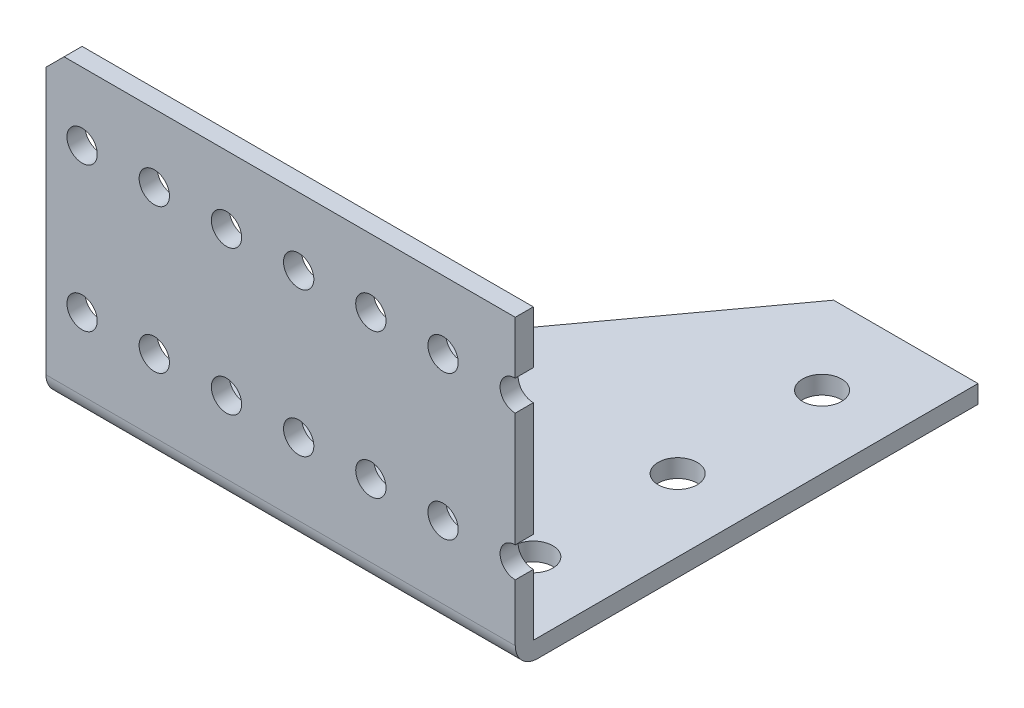
ISO-10303-21;
HEADER;
FILE_DESCRIPTION(('STEP AP214'),'2;1');
FILE_NAME('part.step','',(''),(''),'','','');
FILE_SCHEMA(('AUTOMOTIVE_DESIGN { 1 0 10303 214 1 1 1 1 }'));
ENDSEC;
DATA;
#1=APPLICATION_CONTEXT('core data for automotive mechanical design processes');
#2=APPLICATION_PROTOCOL_DEFINITION('international standard','automotive_design',2000,#1);
#3=PRODUCT_CONTEXT('',#1,'mechanical');
#4=PRODUCT('Part','Part','',(#3));
#5=PRODUCT_RELATED_PRODUCT_CATEGORY('part','',(#4));
#6=PRODUCT_DEFINITION_FORMATION('','',#4);
#7=PRODUCT_DEFINITION_CONTEXT('part definition',#1,'design');
#8=PRODUCT_DEFINITION('design','',#6,#7);
#9=PRODUCT_DEFINITION_SHAPE('','',#8);
#10=(LENGTH_UNIT() NAMED_UNIT(*) SI_UNIT(.MILLI.,.METRE.));
#11=(NAMED_UNIT(*) PLANE_ANGLE_UNIT() SI_UNIT($,.RADIAN.));
#12=(NAMED_UNIT(*) SI_UNIT($,.STERADIAN.) SOLID_ANGLE_UNIT());
#13=UNCERTAINTY_MEASURE_WITH_UNIT(LENGTH_MEASURE(1.E-05),#10,'distance_accuracy_value','');
#14=(GEOMETRIC_REPRESENTATION_CONTEXT(3) GLOBAL_UNCERTAINTY_ASSIGNED_CONTEXT((#13)) GLOBAL_UNIT_ASSIGNED_CONTEXT((#10,
#11,#12)) REPRESENTATION_CONTEXT('',''));
#15=CARTESIAN_POINT('',(0.,0.,0.));
#16=DIRECTION('',(0.,0.,1.));
#17=DIRECTION('',(1.,0.,0.));
#18=AXIS2_PLACEMENT_3D('',#15,#16,#17);
#19=CARTESIAN_POINT('',(41.275,-31.75,40.7035));
#20=DIRECTION('',(-1.,0.,0.));
#21=DIRECTION('',(0.,0.,1.));
#22=AXIS2_PLACEMENT_3D('',#19,#20,#21);
#23=PLANE('',#22);
#24=DIRECTION('',(0.,-1.,0.));
#25=VECTOR('',#24,1.);
#26=CARTESIAN_POINT('',(41.275,-31.75,40.7035));
#27=LINE('',#26,#25);
#28=CARTESIAN_POINT('',(41.275,19.05,40.7035));
#29=VERTEX_POINT('',#28);
#30=CARTESIAN_POINT('',(41.275,9.77899999999999,40.7035));
#31=VERTEX_POINT('',#30);
#32=EDGE_CURVE('E173',#29,#31,#27,.T.);
#33=ORIENTED_EDGE('',*,*,#32,.T.);
#34=DIRECTION('',(0.,0.,-1.));
#35=VECTOR('',#34,1.);
#36=CARTESIAN_POINT('',(41.275,9.779,-40.7035));
#37=LINE('',#36,#35);
#38=CARTESIAN_POINT('',(41.275,9.779,37.5284999999999));
#39=VERTEX_POINT('',#38);
#40=EDGE_CURVE('E186',#31,#39,#37,.T.);
#41=ORIENTED_EDGE('',*,*,#40,.T.);
#42=DIRECTION('',(0.,-1.,0.));
#43=VECTOR('',#42,1.);
#44=CARTESIAN_POINT('',(41.275,19.05,37.5284999999999));
#45=LINE('',#44,#43);
#46=CARTESIAN_POINT('',(41.275,19.05,37.5284999999999));
#47=VERTEX_POINT('',#46);
#48=EDGE_CURVE('E164',#47,#39,#45,.T.);
#49=ORIENTED_EDGE('',*,*,#48,.F.);
#50=DIRECTION('',(0.,0.,-1.));
#51=VECTOR('',#50,1.);
#52=CARTESIAN_POINT('',(41.275,19.05,40.7035));
#53=LINE('',#52,#51);
#54=EDGE_CURVE('E266',#29,#47,#53,.T.);
#55=ORIENTED_EDGE('',*,*,#54,.F.);
#56=EDGE_LOOP('',(#33,#41,#49,#55));
#57=FACE_BOUND('',#56,.T.);
#58=ADVANCED_FACE('F47',(#57),#23,.F.);
#59=CARTESIAN_POINT('',(41.275,4.44500000000004,37.5284999999999));
#60=VERTEX_POINT('',#59);
#61=CARTESIAN_POINT('',(41.275,-15.621,37.5284999999999));
#62=VERTEX_POINT('',#61);
#63=EDGE_CURVE('E274',#60,#62,#45,.T.);
#64=ORIENTED_EDGE('',*,*,#63,.F.);
#65=DIRECTION('',(0.,0.,-1.));
#66=VECTOR('',#65,1.);
#67=CARTESIAN_POINT('',(41.275,4.44500000000004,-40.7035));
#68=LINE('',#67,#66);
#69=CARTESIAN_POINT('',(41.275,4.44500000000004,40.7035));
#70=VERTEX_POINT('',#69);
#71=EDGE_CURVE('E183',#60,#70,#68,.F.);
#72=ORIENTED_EDGE('',*,*,#71,.T.);
#73=CARTESIAN_POINT('',(41.275,-15.621,40.7035));
#74=VERTEX_POINT('',#73);
#75=EDGE_CURVE('E177',#70,#74,#27,.T.);
#76=ORIENTED_EDGE('',*,*,#75,.T.);
#77=DIRECTION('',(0.,0.,-1.));
#78=VECTOR('',#77,1.);
#79=CARTESIAN_POINT('',(41.275,-15.621,-40.7035));
#80=LINE('',#79,#78);
#81=EDGE_CURVE('E180',#74,#62,#80,.T.);
#82=ORIENTED_EDGE('',*,*,#81,.T.);
#83=EDGE_LOOP('',(#64,#72,#76,#82));
#84=FACE_BOUND('',#83,.T.);
#85=ADVANCED_FACE('F286',(#84),#23,.F.);
#86=CARTESIAN_POINT('',(-41.275,-31.75,40.7035));
#87=DIRECTION('',(0.,0.,-1.));
#88=DIRECTION('',(-1.,0.,0.));
#89=AXIS2_PLACEMENT_3D('',#86,#87,#88);
#90=PLANE('',#89);
#91=CARTESIAN_POINT('',(-22.225,7.11200000000002,40.7035));
#92=DIRECTION('',(0.,0.,-1.));
#93=DIRECTION('',(-1.,0.,0.));
#94=AXIS2_PLACEMENT_3D('',#91,#92,#93);
#95=CIRCLE('',#94,2.66699999999997);
#96=CARTESIAN_POINT('',(-24.892,7.11200000000002,40.7035));
#97=VERTEX_POINT('',#96);
#98=EDGE_CURVE('E330',#97,#97,#95,.T.);
#99=ORIENTED_EDGE('',*,*,#98,.T.);
#100=EDGE_LOOP('',(#99));
#101=FACE_BOUND('',#100,.T.);
#102=CARTESIAN_POINT('',(-9.52499999999998,7.11200000000002,40.7035));
#103=DIRECTION('',(0.,0.,-1.));
#104=DIRECTION('',(-1.,0.,0.));
#105=AXIS2_PLACEMENT_3D('',#102,#103,#104);
#106=CIRCLE('',#105,2.66699999999998);
#107=CARTESIAN_POINT('',(-12.192,7.11200000000002,40.7035));
#108=VERTEX_POINT('',#107);
#109=EDGE_CURVE('E217',#108,#108,#106,.T.);
#110=ORIENTED_EDGE('',*,*,#109,.T.);
#111=EDGE_LOOP('',(#110));
#112=FACE_BOUND('',#111,.T.);
#113=CARTESIAN_POINT('',(3.17500000000006,7.11200000000002,40.7035));
#114=DIRECTION('',(0.,0.,-1.));
#115=DIRECTION('',(-1.,0.,0.));
#116=AXIS2_PLACEMENT_3D('',#113,#114,#115);
#117=CIRCLE('',#116,2.66699999999998);
#118=CARTESIAN_POINT('',(0.508000000000084,7.11200000000002,40.7035));
#119=VERTEX_POINT('',#118);
#120=EDGE_CURVE('E216',#119,#119,#117,.T.);
#121=ORIENTED_EDGE('',*,*,#120,.T.);
#122=EDGE_LOOP('',(#121));
#123=FACE_BOUND('',#122,.T.);
#124=CARTESIAN_POINT('',(15.8750000000001,7.11200000000002,40.7035));
#125=DIRECTION('',(0.,0.,-1.));
#126=DIRECTION('',(-1.,0.,0.));
#127=AXIS2_PLACEMENT_3D('',#124,#125,#126);
#128=CIRCLE('',#127,2.66699999999997);
#129=CARTESIAN_POINT('',(13.2080000000001,7.11200000000002,40.7035));
#130=VERTEX_POINT('',#129);
#131=EDGE_CURVE('E340',#130,#130,#128,.T.);
#132=ORIENTED_EDGE('',*,*,#131,.T.);
#133=EDGE_LOOP('',(#132));
#134=FACE_BOUND('',#133,.T.);
#135=CARTESIAN_POINT('',(28.5750000000001,7.11200000000002,40.7035));
#136=DIRECTION('',(0.,0.,-1.));
#137=DIRECTION('',(-1.,0.,0.));
#138=AXIS2_PLACEMENT_3D('',#135,#136,#137);
#139=CIRCLE('',#138,2.66699999999997);
#140=CARTESIAN_POINT('',(25.9080000000001,7.11200000000002,40.7035));
#141=VERTEX_POINT('',#140);
#142=EDGE_CURVE('E212',#141,#141,#139,.T.);
#143=ORIENTED_EDGE('',*,*,#142,.T.);
#144=EDGE_LOOP('',(#143));
#145=FACE_BOUND('',#144,.T.);
#146=CARTESIAN_POINT('',(-22.225,-18.2879999999999,40.7035));
#147=DIRECTION('',(0.,0.,-1.));
#148=DIRECTION('',(-1.,0.,0.));
#149=AXIS2_PLACEMENT_3D('',#146,#147,#148);
#150=CIRCLE('',#149,2.66699999999997);
#151=CARTESIAN_POINT('',(-24.892,-18.2879999999999,40.7035));
#152=VERTEX_POINT('',#151);
#153=EDGE_CURVE('E208',#152,#152,#150,.T.);
#154=ORIENTED_EDGE('',*,*,#153,.T.);
#155=EDGE_LOOP('',(#154));
#156=FACE_BOUND('',#155,.T.);
#157=CARTESIAN_POINT('',(-9.52499999999998,-18.2879999999999,40.7035));
#158=DIRECTION('',(0.,0.,-1.));
#159=DIRECTION('',(-1.,0.,0.));
#160=AXIS2_PLACEMENT_3D('',#157,#158,#159);
#161=CIRCLE('',#160,2.66699999999998);
#162=CARTESIAN_POINT('',(-12.192,-18.2879999999999,40.7035));
#163=VERTEX_POINT('',#162);
#164=EDGE_CURVE('E207',#163,#163,#161,.T.);
#165=ORIENTED_EDGE('',*,*,#164,.T.);
#166=EDGE_LOOP('',(#165));
#167=FACE_BOUND('',#166,.T.);
#168=CARTESIAN_POINT('',(3.17500000000006,-18.2879999999999,40.7035));
#169=DIRECTION('',(0.,0.,-1.));
#170=DIRECTION('',(-1.,0.,0.));
#171=AXIS2_PLACEMENT_3D('',#168,#169,#170);
#172=CIRCLE('',#171,2.66699999999998);
#173=CARTESIAN_POINT('',(0.508000000000084,-18.2879999999999,40.7035));
#174=VERTEX_POINT('',#173);
#175=EDGE_CURVE('E203',#174,#174,#172,.T.);
#176=ORIENTED_EDGE('',*,*,#175,.T.);
#177=EDGE_LOOP('',(#176));
#178=FACE_BOUND('',#177,.T.);
#179=CARTESIAN_POINT('',(15.8750000000001,-18.2879999999999,40.7035));
#180=DIRECTION('',(0.,0.,-1.));
#181=DIRECTION('',(-1.,0.,0.));
#182=AXIS2_PLACEMENT_3D('',#179,#180,#181);
#183=CIRCLE('',#182,2.66699999999997);
#184=CARTESIAN_POINT('',(13.2080000000001,-18.2879999999999,40.7035));
#185=VERTEX_POINT('',#184);
#186=EDGE_CURVE('E202',#185,#185,#183,.T.);
#187=ORIENTED_EDGE('',*,*,#186,.T.);
#188=EDGE_LOOP('',(#187));
#189=FACE_BOUND('',#188,.T.);
#190=CARTESIAN_POINT('',(28.5750000000001,-18.2879999999999,40.7035));
#191=DIRECTION('',(0.,0.,-1.));
#192=DIRECTION('',(-1.,0.,0.));
#193=AXIS2_PLACEMENT_3D('',#190,#191,#192);
#194=CIRCLE('',#193,2.66699999999997);
#195=CARTESIAN_POINT('',(25.9080000000001,-18.2879999999999,40.7035));
#196=VERTEX_POINT('',#195);
#197=EDGE_CURVE('E198',#196,#196,#194,.T.);
#198=ORIENTED_EDGE('',*,*,#197,.T.);
#199=EDGE_LOOP('',(#198));
#200=FACE_BOUND('',#199,.T.);
#201=CARTESIAN_POINT('',(-34.925,7.11200000000002,40.7035));
#202=DIRECTION('',(0.,0.,-1.));
#203=DIRECTION('',(-1.,0.,0.));
#204=AXIS2_PLACEMENT_3D('',#201,#202,#203);
#205=CIRCLE('',#204,2.66699999999997);
#206=CARTESIAN_POINT('',(-37.592,7.11200000000002,40.7035));
#207=VERTEX_POINT('',#206);
#208=EDGE_CURVE('E194',#207,#207,#205,.T.);
#209=ORIENTED_EDGE('',*,*,#208,.T.);
#210=EDGE_LOOP('',(#209));
#211=FACE_BOUND('',#210,.T.);
#212=CARTESIAN_POINT('',(-34.925,-18.2879999999999,40.7035));
#213=DIRECTION('',(0.,0.,-1.));
#214=DIRECTION('',(-1.,0.,0.));
#215=AXIS2_PLACEMENT_3D('',#212,#213,#214);
#216=CIRCLE('',#215,2.66699999999997);
#217=CARTESIAN_POINT('',(-37.592,-18.2879999999999,40.7035));
#218=VERTEX_POINT('',#217);
#219=EDGE_CURVE('E193',#218,#218,#216,.T.);
#220=ORIENTED_EDGE('',*,*,#219,.T.);
#221=EDGE_LOOP('',(#220));
#222=FACE_BOUND('',#221,.T.);
#223=DIRECTION('',(0.,-1.,0.));
#224=VECTOR('',#223,1.);
#225=CARTESIAN_POINT('',(-41.275,-31.75,40.7035));
#226=LINE('',#225,#224);
#227=CARTESIAN_POINT('',(-41.275,15.875,40.7035));
#228=VERTEX_POINT('',#227);
#229=CARTESIAN_POINT('',(-41.275,-30.988,40.7035));
#230=VERTEX_POINT('',#229);
#231=EDGE_CURVE('E168',#228,#230,#226,.T.);
#232=ORIENTED_EDGE('',*,*,#231,.T.);
#233=DIRECTION('',(1.,0.,0.));
#234=VECTOR('',#233,1.);
#235=CARTESIAN_POINT('',(-41.275,-30.988,40.7035));
#236=LINE('',#235,#234);
#237=CARTESIAN_POINT('',(41.275,-30.988,40.7035));
#238=VERTEX_POINT('',#237);
#239=EDGE_CURVE('E226',#230,#238,#236,.T.);
#240=ORIENTED_EDGE('',*,*,#239,.T.);
#241=CARTESIAN_POINT('',(41.275,-20.9549999999999,40.7035));
#242=VERTEX_POINT('',#241);
#243=EDGE_CURVE('E172',#242,#238,#27,.T.);
#244=ORIENTED_EDGE('',*,*,#243,.F.);
#245=CARTESIAN_POINT('',(41.275,-18.2879999999999,40.7035));
#246=DIRECTION('',(0.,0.,-1.));
#247=DIRECTION('',(-1.,0.,0.));
#248=AXIS2_PLACEMENT_3D('',#245,#246,#247);
#249=CIRCLE('',#248,2.66699999999997);
#250=EDGE_CURVE('E268',#242,#74,#249,.T.);
#251=ORIENTED_EDGE('',*,*,#250,.T.);
#252=ORIENTED_EDGE('',*,*,#75,.F.);
#253=CARTESIAN_POINT('',(41.275,7.11200000000002,40.7035));
#254=DIRECTION('',(0.,0.,-1.));
#255=DIRECTION('',(-1.,0.,0.));
#256=AXIS2_PLACEMENT_3D('',#253,#254,#255);
#257=CIRCLE('',#256,2.66699999999997);
#258=EDGE_CURVE('E291',#70,#31,#257,.T.);
#259=ORIENTED_EDGE('',*,*,#258,.T.);
#260=ORIENTED_EDGE('',*,*,#32,.F.);
#261=DIRECTION('',(1.,0.,0.));
#262=VECTOR('',#261,1.);
#263=CARTESIAN_POINT('',(41.275,19.05,40.7035));
#264=LINE('',#263,#262);
#265=CARTESIAN_POINT('',(-38.1,19.05,40.7035));
#266=VERTEX_POINT('',#265);
#267=EDGE_CURVE('E263',#266,#29,#264,.T.);
#268=ORIENTED_EDGE('',*,*,#267,.F.);
#269=DIRECTION('',(0.707106781186544,0.707106781186551,0.));
#270=VECTOR('',#269,1.);
#271=CARTESIAN_POINT('',(-38.1,19.05,40.7035));
#272=LINE('',#271,#270);
#273=EDGE_CURVE('E220',#266,#228,#272,.F.);
#274=ORIENTED_EDGE('',*,*,#273,.T.);
#275=EDGE_LOOP('',(#232,#240,#244,#251,#252,#259,#260,#268,#274));
#276=FACE_BOUND('',#275,.T.);
#277=ADVANCED_FACE('F240',(#101,#112,#123,#134,#145,#156,#167,#178,#189,#200,#211,#222,#276),
#90,.F.);
#278=ORIENTED_EDGE('',*,*,#243,.T.);
#279=CARTESIAN_POINT('',(41.275,-30.988,36.7665));
#280=DIRECTION('',(-1.,0.,0.));
#281=DIRECTION('',(0.,0.,1.));
#282=AXIS2_PLACEMENT_3D('',#279,#280,#281);
#283=CIRCLE('',#282,3.937);
#284=CARTESIAN_POINT('',(41.275,-34.925,36.7665));
#285=VERTEX_POINT('',#284);
#286=EDGE_CURVE('E69',#238,#285,#283,.F.);
#287=ORIENTED_EDGE('',*,*,#286,.T.);
#288=DIRECTION('',(0.,0.,-1.));
#289=VECTOR('',#288,1.);
#290=CARTESIAN_POINT('',(41.275,-34.925,40.7035));
#291=LINE('',#290,#289);
#292=CARTESIAN_POINT('',(41.275,-34.925,-40.7035));
#293=VERTEX_POINT('',#292);
#294=EDGE_CURVE('E160',#285,#293,#291,.T.);
#295=ORIENTED_EDGE('',*,*,#294,.T.);
#296=DIRECTION('',(0.,-1.,0.));
#297=VECTOR('',#296,1.);
#298=CARTESIAN_POINT('',(41.275,-31.75,-40.7035));
#299=LINE('',#298,#297);
#300=CARTESIAN_POINT('',(41.275,-31.75,-40.7035));
#301=VERTEX_POINT('',#300);
#302=EDGE_CURVE('E158',#301,#293,#299,.T.);
#303=ORIENTED_EDGE('',*,*,#302,.F.);
#304=DIRECTION('',(0.,0.,-1.));
#305=VECTOR('',#304,1.);
#306=CARTESIAN_POINT('',(41.275,-31.75,40.7035));
#307=LINE('',#306,#305);
#308=CARTESIAN_POINT('',(41.275,-31.75,37.5284999999999));
#309=VERTEX_POINT('',#308);
#310=EDGE_CURVE('E159',#309,#301,#307,.T.);
#311=ORIENTED_EDGE('',*,*,#310,.F.);
#312=CARTESIAN_POINT('',(41.275,-20.9549999999999,37.5284999999999));
#313=VERTEX_POINT('',#312);
#314=EDGE_CURVE('E257',#313,#309,#45,.T.);
#315=ORIENTED_EDGE('',*,*,#314,.F.);
#316=DIRECTION('',(0.,0.,-1.));
#317=VECTOR('',#316,1.);
#318=CARTESIAN_POINT('',(41.275,-20.9549999999999,-40.7035));
#319=LINE('',#318,#317);
#320=EDGE_CURVE('E176',#313,#242,#319,.F.);
#321=ORIENTED_EDGE('',*,*,#320,.T.);
#322=EDGE_LOOP('',(#278,#287,#295,#303,#311,#315,#321));
#323=FACE_BOUND('',#322,.T.);
#324=ADVANCED_FACE('F289',(#323),#23,.F.);
#325=CARTESIAN_POINT('',(41.275,-31.75,-40.7035));
#326=DIRECTION('',(0.,0.,1.));
#327=DIRECTION('',(1.,0.,0.));
#328=AXIS2_PLACEMENT_3D('',#325,#326,#327);
#329=PLANE('',#328);
#330=DIRECTION('',(-1.,0.,0.));
#331=VECTOR('',#330,1.);
#332=CARTESIAN_POINT('',(41.275,-34.925,-40.7035));
#333=LINE('',#332,#331);
#334=CARTESIAN_POINT('',(15.875,-34.925,-40.7035));
#335=VERTEX_POINT('',#334);
#336=EDGE_CURVE('E150',#293,#335,#333,.T.);
#337=ORIENTED_EDGE('',*,*,#336,.T.);
#338=DIRECTION('',(0.,-1.,0.));
#339=VECTOR('',#338,1.);
#340=CARTESIAN_POINT('',(15.875,19.05,-40.7035));
#341=LINE('',#340,#339);
#342=CARTESIAN_POINT('',(15.875,-31.75,-40.7035));
#343=VERTEX_POINT('',#342);
#344=EDGE_CURVE('E136',#343,#335,#341,.T.);
#345=ORIENTED_EDGE('',*,*,#344,.F.);
#346=DIRECTION('',(-1.,0.,0.));
#347=VECTOR('',#346,1.);
#348=CARTESIAN_POINT('',(41.275,-31.75,-40.7035));
#349=LINE('',#348,#347);
#350=EDGE_CURVE('E162',#301,#343,#349,.T.);
#351=ORIENTED_EDGE('',*,*,#350,.F.);
#352=ORIENTED_EDGE('',*,*,#302,.T.);
#353=EDGE_LOOP('',(#337,#345,#351,#352));
#354=FACE_BOUND('',#353,.T.);
#355=ADVANCED_FACE('F156',(#354),#329,.F.);
#356=CARTESIAN_POINT('',(-41.275,-31.75,40.7035));
#357=DIRECTION('',(1.,0.,0.));
#358=DIRECTION('',(0.,0.,-1.));
#359=AXIS2_PLACEMENT_3D('',#356,#357,#358);
#360=PLANE('',#359);
#361=DIRECTION('',(0.,-1.,0.));
#362=VECTOR('',#361,1.);
#363=CARTESIAN_POINT('',(-41.275,19.05,37.5284999999999));
#364=LINE('',#363,#362);
#365=CARTESIAN_POINT('',(-41.275,15.875,37.5284999999999));
#366=VERTEX_POINT('',#365);
#367=CARTESIAN_POINT('',(-41.275,-31.75,37.5284999999999));
#368=VERTEX_POINT('',#367);
#369=EDGE_CURVE('E254',#366,#368,#364,.T.);
#370=ORIENTED_EDGE('',*,*,#369,.T.);
#371=DIRECTION('',(0.,-1.,0.));
#372=VECTOR('',#371,1.);
#373=CARTESIAN_POINT('',(-41.275,19.05,37.5284999999999));
#374=LINE('',#373,#372);
#375=CARTESIAN_POINT('',(-41.275,-34.8505542067394,37.5284999999999));
#376=VERTEX_POINT('',#375);
#377=EDGE_CURVE('E144',#368,#376,#374,.T.);
#378=ORIENTED_EDGE('',*,*,#377,.T.);
#379=CARTESIAN_POINT('',(-41.275,-30.988,36.7665));
#380=DIRECTION('',(1.,0.,0.));
#381=DIRECTION('',(0.,0.,-1.));
#382=AXIS2_PLACEMENT_3D('',#379,#380,#381);
#383=CIRCLE('',#382,3.937);
#384=EDGE_CURVE('E55',#376,#230,#383,.F.);
#385=ORIENTED_EDGE('',*,*,#384,.T.);
#386=ORIENTED_EDGE('',*,*,#231,.F.);
#387=DIRECTION('',(0.,0.,-1.));
#388=VECTOR('',#387,1.);
#389=CARTESIAN_POINT('',(-41.275,15.875,40.7035));
#390=LINE('',#389,#388);
#391=EDGE_CURVE('E222',#228,#366,#390,.T.);
#392=ORIENTED_EDGE('',*,*,#391,.T.);
#393=EDGE_LOOP('',(#370,#378,#385,#386,#392));
#394=FACE_BOUND('',#393,.T.);
#395=ADVANCED_FACE('F235',(#394),#360,.F.);
#396=CARTESIAN_POINT('',(0.,-31.75,0.));
#397=DIRECTION('',(0.,1.,0.));
#398=DIRECTION('',(0.,0.,1.));
#399=AXIS2_PLACEMENT_3D('',#396,#397,#398);
#400=PLANE('',#399);
#401=DIRECTION('',(0.589885116714,0.,-0.807487181990718));
#402=VECTOR('',#401,1.);
#403=CARTESIAN_POINT('',(-9.03701688787468,-31.75,-6.601716882376));
#404=LINE('',#403,#402);
#405=EDGE_CURVE('E139',#368,#343,#404,.T.);
#406=ORIENTED_EDGE('',*,*,#405,.F.);
#407=DIRECTION('',(-1.,0.,0.));
#408=VECTOR('',#407,1.);
#409=CARTESIAN_POINT('',(-41.275,-31.75,37.5284999999999));
#410=LINE('',#409,#408);
#411=EDGE_CURVE('E249',#309,#368,#410,.T.);
#412=ORIENTED_EDGE('',*,*,#411,.F.);
#413=ORIENTED_EDGE('',*,*,#310,.T.);
#414=ORIENTED_EDGE('',*,*,#350,.T.);
#415=EDGE_LOOP('',(#406,#412,#413,#414));
#416=FACE_BOUND('',#415,.T.);
#417=CARTESIAN_POINT('',(28.575,-31.75,24.8284999999999));
#418=DIRECTION('',(0.,1.,0.));
#419=DIRECTION('',(0.,0.,1.));
#420=AXIS2_PLACEMENT_3D('',#417,#418,#419);
#421=CIRCLE('',#420,3.429);
#422=CARTESIAN_POINT('',(28.575,-31.75,28.2574999999999));
#423=VERTEX_POINT('',#422);
#424=EDGE_CURVE('E620',#423,#423,#421,.T.);
#425=ORIENTED_EDGE('',*,*,#424,.F.);
#426=EDGE_LOOP('',(#425));
#427=FACE_BOUND('',#426,.T.);
#428=CARTESIAN_POINT('',(28.5750000000003,-31.75,-0.571500000000103));
#429=DIRECTION('',(0.,1.,0.));
#430=DIRECTION('',(0.,0.,1.));
#431=AXIS2_PLACEMENT_3D('',#428,#429,#430);
#432=CIRCLE('',#431,3.429);
#433=CARTESIAN_POINT('',(28.5750000000003,-31.75,2.8574999999999));
#434=VERTEX_POINT('',#433);
#435=EDGE_CURVE('E634',#434,#434,#432,.T.);
#436=ORIENTED_EDGE('',*,*,#435,.F.);
#437=EDGE_LOOP('',(#436));
#438=FACE_BOUND('',#437,.T.);
#439=CARTESIAN_POINT('',(28.5750000000005,-31.75,-25.9715000000001));
#440=DIRECTION('',(0.,1.,0.));
#441=DIRECTION('',(0.,0.,1.));
#442=AXIS2_PLACEMENT_3D('',#439,#440,#441);
#443=CIRCLE('',#442,3.429);
#444=CARTESIAN_POINT('',(28.5750000000005,-31.75,-22.5425000000001));
#445=VERTEX_POINT('',#444);
#446=EDGE_CURVE('E251',#445,#445,#443,.T.);
#447=ORIENTED_EDGE('',*,*,#446,.F.);
#448=EDGE_LOOP('',(#447));
#449=FACE_BOUND('',#448,.T.);
#450=ADVANCED_FACE('F246',(#416,#427,#438,#449),#400,.T.);
#451=CARTESIAN_POINT('',(0.,-34.925,0.));
#452=DIRECTION('',(0.,1.,0.));
#453=DIRECTION('',(0.,0.,1.));
#454=AXIS2_PLACEMENT_3D('',#451,#452,#453);
#455=PLANE('',#454);
#456=CARTESIAN_POINT('',(28.575,-34.925,24.8284999999999));
#457=DIRECTION('',(0.,-1.,0.));
#458=DIRECTION('',(0.,0.,-1.));
#459=AXIS2_PLACEMENT_3D('',#456,#457,#458);
#460=CIRCLE('',#459,3.429);
#461=CARTESIAN_POINT('',(28.575,-34.925,21.3994999999999));
#462=VERTEX_POINT('',#461);
#463=EDGE_CURVE('E153',#462,#462,#460,.T.);
#464=ORIENTED_EDGE('',*,*,#463,.F.);
#465=EDGE_LOOP('',(#464));
#466=FACE_BOUND('',#465,.T.);
#467=CARTESIAN_POINT('',(28.5750000000003,-34.925,-0.571500000000103));
#468=DIRECTION('',(0.,-1.,0.));
#469=DIRECTION('',(0.,0.,-1.));
#470=AXIS2_PLACEMENT_3D('',#467,#468,#469);
#471=CIRCLE('',#470,3.429);
#472=CARTESIAN_POINT('',(28.5750000000003,-34.925,-4.0005000000001));
#473=VERTEX_POINT('',#472);
#474=EDGE_CURVE('E623',#473,#473,#471,.T.);
#475=ORIENTED_EDGE('',*,*,#474,.F.);
#476=EDGE_LOOP('',(#475));
#477=FACE_BOUND('',#476,.T.);
#478=CARTESIAN_POINT('',(28.5750000000005,-34.925,-25.9715000000001));
#479=DIRECTION('',(0.,-1.,0.));
#480=DIRECTION('',(0.,0.,-1.));
#481=AXIS2_PLACEMENT_3D('',#478,#479,#480);
#482=CIRCLE('',#481,3.429);
#483=CARTESIAN_POINT('',(28.5750000000005,-34.925,-29.4005000000001));
#484=VERTEX_POINT('',#483);
#485=EDGE_CURVE('E626',#484,#484,#482,.T.);
#486=ORIENTED_EDGE('',*,*,#485,.F.);
#487=EDGE_LOOP('',(#486));
#488=FACE_BOUND('',#487,.T.);
#489=DIRECTION('',(1.,0.,0.));
#490=VECTOR('',#489,1.);
#491=CARTESIAN_POINT('',(0.,-34.925,36.7665));
#492=LINE('',#491,#490);
#493=CARTESIAN_POINT('',(-40.7183441558442,-34.925,36.7665));
#494=VERTEX_POINT('',#493);
#495=EDGE_CURVE('E152',#285,#494,#492,.F.);
#496=ORIENTED_EDGE('',*,*,#495,.T.);
#497=DIRECTION('',(-0.589885116714,0.,0.807487181990718));
#498=VECTOR('',#497,1.);
#499=CARTESIAN_POINT('',(-41.275,-34.925,37.5284999999999));
#500=LINE('',#499,#498);
#501=EDGE_CURVE('E61',#335,#494,#500,.T.);
#502=ORIENTED_EDGE('',*,*,#501,.F.);
#503=ORIENTED_EDGE('',*,*,#336,.F.);
#504=ORIENTED_EDGE('',*,*,#294,.F.);
#505=EDGE_LOOP('',(#496,#502,#503,#504));
#506=FACE_BOUND('',#505,.T.);
#507=ADVANCED_FACE('F149',(#466,#477,#488,#506),#455,.F.);
#508=CARTESIAN_POINT('',(-41.275,19.05,37.5284999999999));
#509=DIRECTION('',(0.,0.,1.));
#510=DIRECTION('',(1.,0.,0.));
#511=AXIS2_PLACEMENT_3D('',#508,#509,#510);
#512=PLANE('',#511);
#513=CARTESIAN_POINT('',(-22.225,7.11200000000002,37.5284999999999));
#514=DIRECTION('',(0.,0.,1.));
#515=DIRECTION('',(1.,0.,0.));
#516=AXIS2_PLACEMENT_3D('',#513,#514,#515);
#517=CIRCLE('',#516,2.66699999999998);
#518=CARTESIAN_POINT('',(-19.558,7.11200000000002,37.5284999999999));
#519=VERTEX_POINT('',#518);
#520=EDGE_CURVE('E639',#519,#519,#517,.T.);
#521=ORIENTED_EDGE('',*,*,#520,.T.);
#522=EDGE_LOOP('',(#521));
#523=FACE_BOUND('',#522,.T.);
#524=CARTESIAN_POINT('',(-9.52499999999998,7.11200000000002,37.5284999999999));
#525=DIRECTION('',(0.,0.,1.));
#526=DIRECTION('',(1.,0.,0.));
#527=AXIS2_PLACEMENT_3D('',#524,#525,#526);
#528=CIRCLE('',#527,2.66699999999998);
#529=CARTESIAN_POINT('',(-6.858,7.11200000000002,37.5284999999999));
#530=VERTEX_POINT('',#529);
#531=EDGE_CURVE('E213',#530,#530,#528,.T.);
#532=ORIENTED_EDGE('',*,*,#531,.T.);
#533=EDGE_LOOP('',(#532));
#534=FACE_BOUND('',#533,.T.);
#535=CARTESIAN_POINT('',(3.17500000000006,7.11200000000002,37.5284999999999));
#536=DIRECTION('',(0.,0.,1.));
#537=DIRECTION('',(1.,0.,0.));
#538=AXIS2_PLACEMENT_3D('',#535,#536,#537);
#539=CIRCLE('',#538,2.66699999999998);
#540=CARTESIAN_POINT('',(5.84200000000004,7.11200000000002,37.5284999999999));
#541=VERTEX_POINT('',#540);
#542=EDGE_CURVE('E644',#541,#541,#539,.T.);
#543=ORIENTED_EDGE('',*,*,#542,.T.);
#544=EDGE_LOOP('',(#543));
#545=FACE_BOUND('',#544,.T.);
#546=CARTESIAN_POINT('',(15.8750000000001,7.11200000000002,37.5284999999999));
#547=DIRECTION('',(0.,0.,1.));
#548=DIRECTION('',(1.,0.,0.));
#549=AXIS2_PLACEMENT_3D('',#546,#547,#548);
#550=CIRCLE('',#549,2.66699999999998);
#551=CARTESIAN_POINT('',(18.5420000000001,7.11200000000002,37.5284999999999));
#552=VERTEX_POINT('',#551);
#553=EDGE_CURVE('E648',#552,#552,#550,.T.);
#554=ORIENTED_EDGE('',*,*,#553,.T.);
#555=EDGE_LOOP('',(#554));
#556=FACE_BOUND('',#555,.T.);
#557=CARTESIAN_POINT('',(28.5750000000001,7.11200000000002,37.5284999999999));
#558=DIRECTION('',(0.,0.,1.));
#559=DIRECTION('',(1.,0.,0.));
#560=AXIS2_PLACEMENT_3D('',#557,#558,#559);
#561=CIRCLE('',#560,2.66699999999998);
#562=CARTESIAN_POINT('',(31.2420000000001,7.11200000000002,37.5284999999999));
#563=VERTEX_POINT('',#562);
#564=EDGE_CURVE('E209',#563,#563,#561,.T.);
#565=ORIENTED_EDGE('',*,*,#564,.T.);
#566=EDGE_LOOP('',(#565));
#567=FACE_BOUND('',#566,.T.);
#568=CARTESIAN_POINT('',(-22.225,-18.2879999999999,37.5284999999999));
#569=DIRECTION('',(0.,0.,1.));
#570=DIRECTION('',(1.,0.,0.));
#571=AXIS2_PLACEMENT_3D('',#568,#569,#570);
#572=CIRCLE('',#571,2.66699999999998);
#573=CARTESIAN_POINT('',(-19.558,-18.2879999999999,37.5284999999999));
#574=VERTEX_POINT('',#573);
#575=EDGE_CURVE('E204',#574,#574,#572,.T.);
#576=ORIENTED_EDGE('',*,*,#575,.T.);
#577=EDGE_LOOP('',(#576));
#578=FACE_BOUND('',#577,.T.);
#579=CARTESIAN_POINT('',(-9.52499999999998,-18.2879999999999,37.5284999999999));
#580=DIRECTION('',(0.,0.,1.));
#581=DIRECTION('',(1.,0.,0.));
#582=AXIS2_PLACEMENT_3D('',#579,#580,#581);
#583=CIRCLE('',#582,2.66699999999998);
#584=CARTESIAN_POINT('',(-6.858,-18.2879999999999,37.5284999999999));
#585=VERTEX_POINT('',#584);
#586=EDGE_CURVE('E654',#585,#585,#583,.T.);
#587=ORIENTED_EDGE('',*,*,#586,.T.);
#588=EDGE_LOOP('',(#587));
#589=FACE_BOUND('',#588,.T.);
#590=CARTESIAN_POINT('',(3.17500000000006,-18.2879999999999,37.5284999999999));
#591=DIRECTION('',(0.,0.,1.));
#592=DIRECTION('',(1.,0.,0.));
#593=AXIS2_PLACEMENT_3D('',#590,#591,#592);
#594=CIRCLE('',#593,2.66699999999998);
#595=CARTESIAN_POINT('',(5.84200000000004,-18.2879999999999,37.5284999999999));
#596=VERTEX_POINT('',#595);
#597=EDGE_CURVE('E199',#596,#596,#594,.T.);
#598=ORIENTED_EDGE('',*,*,#597,.T.);
#599=EDGE_LOOP('',(#598));
#600=FACE_BOUND('',#599,.T.);
#601=CARTESIAN_POINT('',(15.8750000000001,-18.2879999999999,37.5284999999999));
#602=DIRECTION('',(0.,0.,1.));
#603=DIRECTION('',(1.,0.,0.));
#604=AXIS2_PLACEMENT_3D('',#601,#602,#603);
#605=CIRCLE('',#604,2.66699999999998);
#606=CARTESIAN_POINT('',(18.5420000000001,-18.2879999999999,37.5284999999999));
#607=VERTEX_POINT('',#606);
#608=EDGE_CURVE('E659',#607,#607,#605,.T.);
#609=ORIENTED_EDGE('',*,*,#608,.T.);
#610=EDGE_LOOP('',(#609));
#611=FACE_BOUND('',#610,.T.);
#612=CARTESIAN_POINT('',(28.5750000000001,-18.2879999999999,37.5284999999999));
#613=DIRECTION('',(0.,0.,1.));
#614=DIRECTION('',(1.,0.,0.));
#615=AXIS2_PLACEMENT_3D('',#612,#613,#614);
#616=CIRCLE('',#615,2.66699999999998);
#617=CARTESIAN_POINT('',(31.2420000000001,-18.2879999999999,37.5284999999999));
#618=VERTEX_POINT('',#617);
#619=EDGE_CURVE('E195',#618,#618,#616,.T.);
#620=ORIENTED_EDGE('',*,*,#619,.T.);
#621=EDGE_LOOP('',(#620));
#622=FACE_BOUND('',#621,.T.);
#623=CARTESIAN_POINT('',(-34.925,7.11200000000002,37.5284999999999));
#624=DIRECTION('',(0.,0.,1.));
#625=DIRECTION('',(1.,0.,0.));
#626=AXIS2_PLACEMENT_3D('',#623,#624,#625);
#627=CIRCLE('',#626,2.66699999999998);
#628=CARTESIAN_POINT('',(-32.258,7.11200000000002,37.5284999999999));
#629=VERTEX_POINT('',#628);
#630=EDGE_CURVE('E190',#629,#629,#627,.T.);
#631=ORIENTED_EDGE('',*,*,#630,.T.);
#632=EDGE_LOOP('',(#631));
#633=FACE_BOUND('',#632,.T.);
#634=CARTESIAN_POINT('',(-34.925,-18.2879999999999,37.5284999999999));
#635=DIRECTION('',(0.,0.,1.));
#636=DIRECTION('',(1.,0.,0.));
#637=AXIS2_PLACEMENT_3D('',#634,#635,#636);
#638=CIRCLE('',#637,2.66699999999998);
#639=CARTESIAN_POINT('',(-32.258,-18.2879999999999,37.5284999999999));
#640=VERTEX_POINT('',#639);
#641=EDGE_CURVE('E365',#640,#640,#638,.T.);
#642=ORIENTED_EDGE('',*,*,#641,.T.);
#643=EDGE_LOOP('',(#642));
#644=FACE_BOUND('',#643,.T.);
#645=ORIENTED_EDGE('',*,*,#369,.F.);
#646=DIRECTION('',(-0.707106781186544,-0.707106781186551,0.));
#647=VECTOR('',#646,1.);
#648=CARTESIAN_POINT('',(-38.1,19.05,37.5284999999999));
#649=LINE('',#648,#647);
#650=CARTESIAN_POINT('',(-38.1,19.05,37.5284999999999));
#651=VERTEX_POINT('',#650);
#652=EDGE_CURVE('E224',#366,#651,#649,.F.);
#653=ORIENTED_EDGE('',*,*,#652,.T.);
#654=DIRECTION('',(-1.,0.,0.));
#655=VECTOR('',#654,1.);
#656=CARTESIAN_POINT('',(-41.275,19.05,37.5284999999999));
#657=LINE('',#656,#655);
#658=EDGE_CURVE('E258',#47,#651,#657,.T.);
#659=ORIENTED_EDGE('',*,*,#658,.F.);
#660=ORIENTED_EDGE('',*,*,#48,.T.);
#661=CARTESIAN_POINT('',(41.275,7.11200000000002,37.5284999999999));
#662=DIRECTION('',(0.,0.,1.));
#663=DIRECTION('',(1.,0.,0.));
#664=AXIS2_PLACEMENT_3D('',#661,#662,#663);
#665=CIRCLE('',#664,2.66699999999998);
#666=EDGE_CURVE('E280',#39,#60,#665,.T.);
#667=ORIENTED_EDGE('',*,*,#666,.T.);
#668=ORIENTED_EDGE('',*,*,#63,.T.);
#669=CARTESIAN_POINT('',(41.275,-18.2879999999999,37.5284999999999));
#670=DIRECTION('',(0.,0.,1.));
#671=DIRECTION('',(1.,0.,0.));
#672=AXIS2_PLACEMENT_3D('',#669,#670,#671);
#673=CIRCLE('',#672,2.66699999999998);
#674=EDGE_CURVE('E264',#62,#313,#673,.T.);
#675=ORIENTED_EDGE('',*,*,#674,.T.);
#676=ORIENTED_EDGE('',*,*,#314,.T.);
#677=ORIENTED_EDGE('',*,*,#411,.T.);
#678=EDGE_LOOP('',(#645,#653,#659,#660,#667,#668,#675,#676,#677));
#679=FACE_BOUND('',#678,.T.);
#680=ADVANCED_FACE('F260',(#523,#534,#545,#556,#567,#578,#589,#600,#611,#622,#633,#644,#679),
#512,.F.);
#681=CARTESIAN_POINT('',(0.,19.05,0.));
#682=DIRECTION('',(0.,-1.,0.));
#683=DIRECTION('',(0.,0.,-1.));
#684=AXIS2_PLACEMENT_3D('',#681,#682,#683);
#685=PLANE('',#684);
#686=ORIENTED_EDGE('',*,*,#658,.T.);
#687=DIRECTION('',(0.,0.,1.));
#688=VECTOR('',#687,1.);
#689=CARTESIAN_POINT('',(-38.1,19.05,0.));
#690=LINE('',#689,#688);
#691=EDGE_CURVE('E189',#651,#266,#690,.T.);
#692=ORIENTED_EDGE('',*,*,#691,.T.);
#693=ORIENTED_EDGE('',*,*,#267,.T.);
#694=ORIENTED_EDGE('',*,*,#54,.T.);
#695=EDGE_LOOP('',(#686,#692,#693,#694));
#696=FACE_BOUND('',#695,.T.);
#697=ADVANCED_FACE('F298',(#696),#685,.F.);
#698=CARTESIAN_POINT('',(41.275,-18.2879999999999,-40.7035));
#699=DIRECTION('',(0.,0.,-1.));
#700=DIRECTION('',(-1.,0.,0.));
#701=AXIS2_PLACEMENT_3D('',#698,#699,#700);
#702=CYLINDRICAL_SURFACE('',#701,2.66699999999998);
#703=ORIENTED_EDGE('',*,*,#250,.F.);
#704=ORIENTED_EDGE('',*,*,#320,.F.);
#705=ORIENTED_EDGE('',*,*,#674,.F.);
#706=ORIENTED_EDGE('',*,*,#81,.F.);
#707=EDGE_LOOP('',(#703,#704,#705,#706));
#708=FACE_BOUND('',#707,.T.);
#709=ADVANCED_FACE('F284',(#708),#702,.F.);
#710=CARTESIAN_POINT('',(41.275,7.11200000000002,-40.7035));
#711=DIRECTION('',(0.,0.,-1.));
#712=DIRECTION('',(-1.,0.,0.));
#713=AXIS2_PLACEMENT_3D('',#710,#711,#712);
#714=CYLINDRICAL_SURFACE('',#713,2.66699999999998);
#715=ORIENTED_EDGE('',*,*,#258,.F.);
#716=ORIENTED_EDGE('',*,*,#71,.F.);
#717=ORIENTED_EDGE('',*,*,#666,.F.);
#718=ORIENTED_EDGE('',*,*,#40,.F.);
#719=EDGE_LOOP('',(#715,#716,#717,#718));
#720=FACE_BOUND('',#719,.T.);
#721=ADVANCED_FACE('F373',(#720),#714,.F.);
#722=CARTESIAN_POINT('',(-34.925,-18.2879999999999,-40.7035));
#723=DIRECTION('',(0.,0.,-1.));
#724=DIRECTION('',(-1.,0.,0.));
#725=AXIS2_PLACEMENT_3D('',#722,#723,#724);
#726=CYLINDRICAL_SURFACE('',#725,2.66699999999998);
#727=ORIENTED_EDGE('',*,*,#219,.F.);
#728=EDGE_LOOP('',(#727));
#729=FACE_BOUND('',#728,.T.);
#730=ORIENTED_EDGE('',*,*,#641,.F.);
#731=EDGE_LOOP('',(#730));
#732=FACE_BOUND('',#731,.T.);
#733=ADVANCED_FACE('F375',(#729,#732),#726,.F.);
#734=CARTESIAN_POINT('',(-34.925,7.11200000000002,-40.7035));
#735=DIRECTION('',(0.,0.,-1.));
#736=DIRECTION('',(-1.,0.,0.));
#737=AXIS2_PLACEMENT_3D('',#734,#735,#736);
#738=CYLINDRICAL_SURFACE('',#737,2.66699999999998);
#739=ORIENTED_EDGE('',*,*,#208,.F.);
#740=EDGE_LOOP('',(#739));
#741=FACE_BOUND('',#740,.T.);
#742=ORIENTED_EDGE('',*,*,#630,.F.);
#743=EDGE_LOOP('',(#742));
#744=FACE_BOUND('',#743,.T.);
#745=ADVANCED_FACE('F381',(#741,#744),#738,.F.);
#746=CARTESIAN_POINT('',(28.5750000000001,-18.2879999999999,-40.7035));
#747=DIRECTION('',(0.,0.,-1.));
#748=DIRECTION('',(-1.,0.,0.));
#749=AXIS2_PLACEMENT_3D('',#746,#747,#748);
#750=CYLINDRICAL_SURFACE('',#749,2.66699999999998);
#751=ORIENTED_EDGE('',*,*,#197,.F.);
#752=EDGE_LOOP('',(#751));
#753=FACE_BOUND('',#752,.T.);
#754=ORIENTED_EDGE('',*,*,#619,.F.);
#755=EDGE_LOOP('',(#754));
#756=FACE_BOUND('',#755,.T.);
#757=ADVANCED_FACE('F449',(#753,#756),#750,.F.);
#758=CARTESIAN_POINT('',(15.8750000000001,-18.2879999999999,-40.7035));
#759=DIRECTION('',(0.,0.,-1.));
#760=DIRECTION('',(-1.,0.,0.));
#761=AXIS2_PLACEMENT_3D('',#758,#759,#760);
#762=CYLINDRICAL_SURFACE('',#761,2.66699999999998);
#763=ORIENTED_EDGE('',*,*,#186,.F.);
#764=EDGE_LOOP('',(#763));
#765=FACE_BOUND('',#764,.T.);
#766=ORIENTED_EDGE('',*,*,#608,.F.);
#767=EDGE_LOOP('',(#766));
#768=FACE_BOUND('',#767,.T.);
#769=ADVANCED_FACE('F459',(#765,#768),#762,.F.);
#770=CARTESIAN_POINT('',(3.17500000000006,-18.2879999999999,-40.7035));
#771=DIRECTION('',(0.,0.,-1.));
#772=DIRECTION('',(-1.,0.,0.));
#773=AXIS2_PLACEMENT_3D('',#770,#771,#772);
#774=CYLINDRICAL_SURFACE('',#773,2.66699999999998);
#775=ORIENTED_EDGE('',*,*,#175,.F.);
#776=EDGE_LOOP('',(#775));
#777=FACE_BOUND('',#776,.T.);
#778=ORIENTED_EDGE('',*,*,#597,.F.);
#779=EDGE_LOOP('',(#778));
#780=FACE_BOUND('',#779,.T.);
#781=ADVANCED_FACE('F470',(#777,#780),#774,.F.);
#782=CARTESIAN_POINT('',(-9.52499999999998,-18.2879999999999,-40.7035));
#783=DIRECTION('',(0.,0.,-1.));
#784=DIRECTION('',(-1.,0.,0.));
#785=AXIS2_PLACEMENT_3D('',#782,#783,#784);
#786=CYLINDRICAL_SURFACE('',#785,2.66699999999998);
#787=ORIENTED_EDGE('',*,*,#164,.F.);
#788=EDGE_LOOP('',(#787));
#789=FACE_BOUND('',#788,.T.);
#790=ORIENTED_EDGE('',*,*,#586,.F.);
#791=EDGE_LOOP('',(#790));
#792=FACE_BOUND('',#791,.T.);
#793=ADVANCED_FACE('F481',(#789,#792),#786,.F.);
#794=CARTESIAN_POINT('',(-22.225,-18.2879999999999,-40.7035));
#795=DIRECTION('',(0.,0.,-1.));
#796=DIRECTION('',(-1.,0.,0.));
#797=AXIS2_PLACEMENT_3D('',#794,#795,#796);
#798=CYLINDRICAL_SURFACE('',#797,2.66699999999998);
#799=ORIENTED_EDGE('',*,*,#153,.F.);
#800=EDGE_LOOP('',(#799));
#801=FACE_BOUND('',#800,.T.);
#802=ORIENTED_EDGE('',*,*,#575,.F.);
#803=EDGE_LOOP('',(#802));
#804=FACE_BOUND('',#803,.T.);
#805=ADVANCED_FACE('F492',(#801,#804),#798,.F.);
#806=CARTESIAN_POINT('',(28.5750000000001,7.11200000000002,-40.7035));
#807=DIRECTION('',(0.,0.,-1.));
#808=DIRECTION('',(-1.,0.,0.));
#809=AXIS2_PLACEMENT_3D('',#806,#807,#808);
#810=CYLINDRICAL_SURFACE('',#809,2.66699999999998);
#811=ORIENTED_EDGE('',*,*,#142,.F.);
#812=EDGE_LOOP('',(#811));
#813=FACE_BOUND('',#812,.T.);
#814=ORIENTED_EDGE('',*,*,#564,.F.);
#815=EDGE_LOOP('',(#814));
#816=FACE_BOUND('',#815,.T.);
#817=ADVANCED_FACE('F503',(#813,#816),#810,.F.);
#818=CARTESIAN_POINT('',(15.8750000000001,7.11200000000002,-40.7035));
#819=DIRECTION('',(0.,0.,-1.));
#820=DIRECTION('',(-1.,0.,0.));
#821=AXIS2_PLACEMENT_3D('',#818,#819,#820);
#822=CYLINDRICAL_SURFACE('',#821,2.66699999999998);
#823=ORIENTED_EDGE('',*,*,#131,.F.);
#824=EDGE_LOOP('',(#823));
#825=FACE_BOUND('',#824,.T.);
#826=ORIENTED_EDGE('',*,*,#553,.F.);
#827=EDGE_LOOP('',(#826));
#828=FACE_BOUND('',#827,.T.);
#829=ADVANCED_FACE('F514',(#825,#828),#822,.F.);
#830=CARTESIAN_POINT('',(3.17500000000006,7.11200000000002,-40.7035));
#831=DIRECTION('',(0.,0.,-1.));
#832=DIRECTION('',(-1.,0.,0.));
#833=AXIS2_PLACEMENT_3D('',#830,#831,#832);
#834=CYLINDRICAL_SURFACE('',#833,2.66699999999998);
#835=ORIENTED_EDGE('',*,*,#120,.F.);
#836=EDGE_LOOP('',(#835));
#837=FACE_BOUND('',#836,.T.);
#838=ORIENTED_EDGE('',*,*,#542,.F.);
#839=EDGE_LOOP('',(#838));
#840=FACE_BOUND('',#839,.T.);
#841=ADVANCED_FACE('F525',(#837,#840),#834,.F.);
#842=CARTESIAN_POINT('',(-9.52499999999998,7.11200000000002,-40.7035));
#843=DIRECTION('',(0.,0.,-1.));
#844=DIRECTION('',(-1.,0.,0.));
#845=AXIS2_PLACEMENT_3D('',#842,#843,#844);
#846=CYLINDRICAL_SURFACE('',#845,2.66699999999998);
#847=ORIENTED_EDGE('',*,*,#109,.F.);
#848=EDGE_LOOP('',(#847));
#849=FACE_BOUND('',#848,.T.);
#850=ORIENTED_EDGE('',*,*,#531,.F.);
#851=EDGE_LOOP('',(#850));
#852=FACE_BOUND('',#851,.T.);
#853=ADVANCED_FACE('F307',(#849,#852),#846,.F.);
#854=CARTESIAN_POINT('',(-22.225,7.11200000000002,-40.7035));
#855=DIRECTION('',(0.,0.,-1.));
#856=DIRECTION('',(-1.,0.,0.));
#857=AXIS2_PLACEMENT_3D('',#854,#855,#856);
#858=CYLINDRICAL_SURFACE('',#857,2.66699999999998);
#859=ORIENTED_EDGE('',*,*,#98,.F.);
#860=EDGE_LOOP('',(#859));
#861=FACE_BOUND('',#860,.T.);
#862=ORIENTED_EDGE('',*,*,#520,.F.);
#863=EDGE_LOOP('',(#862));
#864=FACE_BOUND('',#863,.T.);
#865=ADVANCED_FACE('F302',(#861,#864),#858,.F.);
#866=CARTESIAN_POINT('',(-38.1,19.05,0.));
#867=DIRECTION('',(0.707106781186551,-0.707106781186544,0.));
#868=DIRECTION('',(0.,0.,1.));
#869=AXIS2_PLACEMENT_3D('',#866,#867,#868);
#870=PLANE('',#869);
#871=ORIENTED_EDGE('',*,*,#652,.F.);
#872=ORIENTED_EDGE('',*,*,#391,.F.);
#873=ORIENTED_EDGE('',*,*,#273,.F.);
#874=ORIENTED_EDGE('',*,*,#691,.F.);
#875=EDGE_LOOP('',(#871,#872,#873,#874));
#876=FACE_BOUND('',#875,.T.);
#877=ADVANCED_FACE('F300',(#876),#870,.F.);
#878=CARTESIAN_POINT('',(-41.275,-30.988,36.7665));
#879=DIRECTION('',(1.,0.,0.));
#880=DIRECTION('',(0.,0.,-1.));
#881=AXIS2_PLACEMENT_3D('',#878,#879,#880);
#882=CYLINDRICAL_SURFACE('',#881,3.937);
#883=CARTESIAN_POINT('',(-40.7183441558442,-30.988,36.7665));
#884=DIRECTION('',(0.807487181990718,0.,0.589885116714));
#885=DIRECTION('',(0.589885116714,0.,-0.807487181990718));
#886=AXIS2_PLACEMENT_3D('',#883,#884,#885);
#887=ELLIPSE('',#886,4.87561918976103,3.937);
#888=EDGE_CURVE('E12',#494,#376,#887,.F.);
#889=ORIENTED_EDGE('',*,*,#888,.F.);
#890=ORIENTED_EDGE('',*,*,#495,.F.);
#891=ORIENTED_EDGE('',*,*,#286,.F.);
#892=ORIENTED_EDGE('',*,*,#239,.F.);
#893=ORIENTED_EDGE('',*,*,#384,.F.);
#894=EDGE_LOOP('',(#889,#890,#891,#892,#893));
#895=FACE_BOUND('',#894,.T.);
#896=ADVANCED_FACE('F49',(#895),#882,.T.);
#897=CARTESIAN_POINT('',(-41.275,19.05,37.5284999999999));
#898=DIRECTION('',(0.807487181990718,0.,0.589885116714));
#899=DIRECTION('',(0.589885116714,0.,-0.807487181990718));
#900=AXIS2_PLACEMENT_3D('',#897,#898,#899);
#901=PLANE('',#900);
#902=ORIENTED_EDGE('',*,*,#405,.T.);
#903=ORIENTED_EDGE('',*,*,#344,.T.);
#904=ORIENTED_EDGE('',*,*,#501,.T.);
#905=ORIENTED_EDGE('',*,*,#888,.T.);
#906=ORIENTED_EDGE('',*,*,#377,.F.);
#907=EDGE_LOOP('',(#902,#903,#904,#905,#906));
#908=FACE_BOUND('',#907,.T.);
#909=ADVANCED_FACE('F137',(#908),#901,.F.);
#910=CARTESIAN_POINT('',(28.5750000000005,19.05,-25.9715000000001));
#911=DIRECTION('',(0.,-1.,0.));
#912=DIRECTION('',(0.,0.,-1.));
#913=AXIS2_PLACEMENT_3D('',#910,#911,#912);
#914=CYLINDRICAL_SURFACE('',#913,3.429);
#915=ORIENTED_EDGE('',*,*,#446,.T.);
#916=EDGE_LOOP('',(#915));
#917=FACE_BOUND('',#916,.T.);
#918=ORIENTED_EDGE('',*,*,#485,.T.);
#919=EDGE_LOOP('',(#918));
#920=FACE_BOUND('',#919,.T.);
#921=ADVANCED_FACE('F577',(#917,#920),#914,.F.);
#922=CARTESIAN_POINT('',(28.5750000000003,19.05,-0.571500000000103));
#923=DIRECTION('',(0.,-1.,0.));
#924=DIRECTION('',(0.,0.,-1.));
#925=AXIS2_PLACEMENT_3D('',#922,#923,#924);
#926=CYLINDRICAL_SURFACE('',#925,3.429);
#927=ORIENTED_EDGE('',*,*,#435,.T.);
#928=EDGE_LOOP('',(#927));
#929=FACE_BOUND('',#928,.T.);
#930=ORIENTED_EDGE('',*,*,#474,.T.);
#931=EDGE_LOOP('',(#930));
#932=FACE_BOUND('',#931,.T.);
#933=ADVANCED_FACE('F587',(#929,#932),#926,.F.);
#934=CARTESIAN_POINT('',(28.575,19.05,24.8284999999999));
#935=DIRECTION('',(0.,-1.,0.));
#936=DIRECTION('',(0.,0.,-1.));
#937=AXIS2_PLACEMENT_3D('',#934,#935,#936);
#938=CYLINDRICAL_SURFACE('',#937,3.429);
#939=ORIENTED_EDGE('',*,*,#424,.T.);
#940=EDGE_LOOP('',(#939));
#941=FACE_BOUND('',#940,.T.);
#942=ORIENTED_EDGE('',*,*,#463,.T.);
#943=EDGE_LOOP('',(#942));
#944=FACE_BOUND('',#943,.T.);
#945=ADVANCED_FACE('F598',(#941,#944),#938,.F.);
#946=CLOSED_SHELL('',(#58,#85,#277,#324,#355,#395,#450,#507,#680,#697,#709,#721,#733,#745,#757,
#769,#781,#793,#805,#817,#829,#841,#853,#865,#877,#896,#909,#921,#933,#945));
#947=MANIFOLD_SOLID_BREP('B2',#946);
#948=ADVANCED_BREP_SHAPE_REPRESENTATION('',(#18,#947),#14);
#949=SHAPE_DEFINITION_REPRESENTATION(#9,#948);
ENDSEC;
END-ISO-10303-21;
